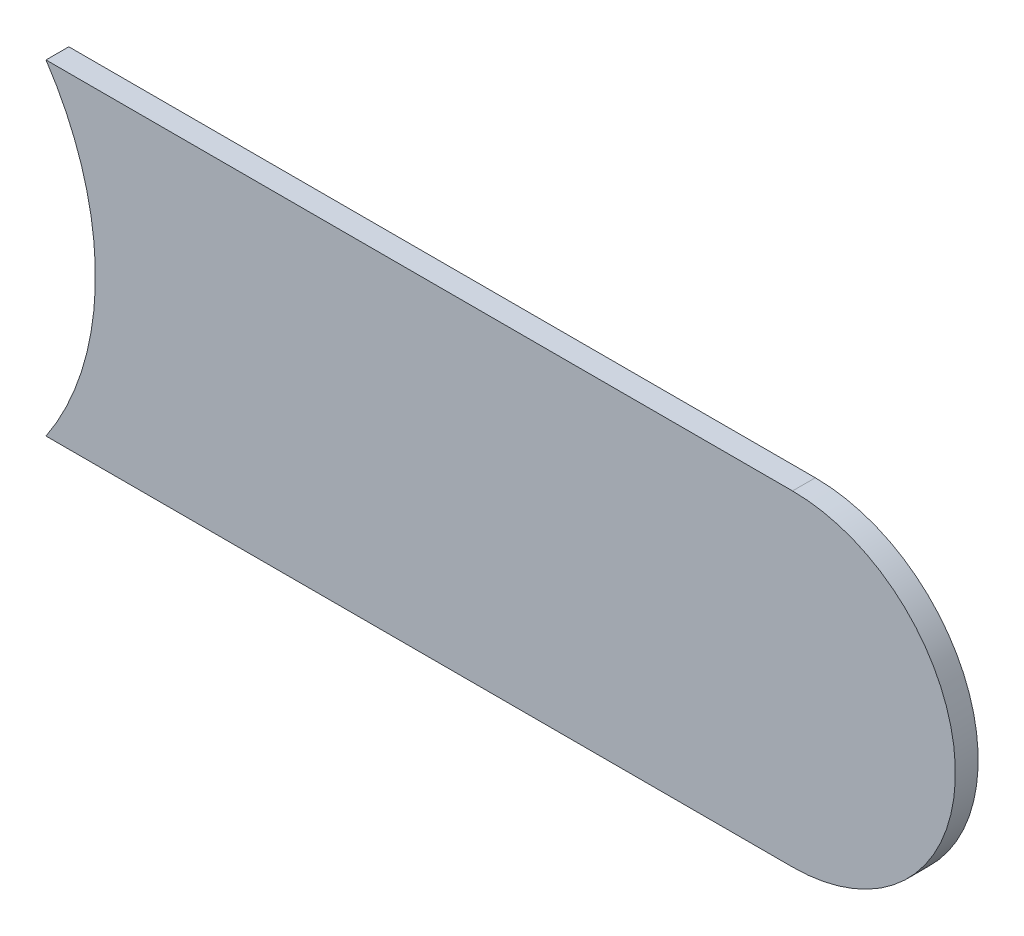
ISO-10303-21;
HEADER;
FILE_DESCRIPTION(('STEP AP214'),'2;1');
FILE_NAME('part.step','',(''),(''),'','','');
FILE_SCHEMA(('AUTOMOTIVE_DESIGN { 1 0 10303 214 1 1 1 1 }'));
ENDSEC;
DATA;
#1=APPLICATION_CONTEXT('core data for automotive mechanical design processes');
#2=APPLICATION_PROTOCOL_DEFINITION('international standard','automotive_design',2000,#1);
#3=PRODUCT_CONTEXT('',#1,'mechanical');
#4=PRODUCT('Part','Part','',(#3));
#5=PRODUCT_RELATED_PRODUCT_CATEGORY('part','',(#4));
#6=PRODUCT_DEFINITION_FORMATION('','',#4);
#7=PRODUCT_DEFINITION_CONTEXT('part definition',#1,'design');
#8=PRODUCT_DEFINITION('design','',#6,#7);
#9=PRODUCT_DEFINITION_SHAPE('','',#8);
#10=(LENGTH_UNIT() NAMED_UNIT(*) SI_UNIT(.MILLI.,.METRE.));
#11=(NAMED_UNIT(*) PLANE_ANGLE_UNIT() SI_UNIT($,.RADIAN.));
#12=(NAMED_UNIT(*) SI_UNIT($,.STERADIAN.) SOLID_ANGLE_UNIT());
#13=UNCERTAINTY_MEASURE_WITH_UNIT(LENGTH_MEASURE(1.E-05),#10,'distance_accuracy_value','');
#14=(GEOMETRIC_REPRESENTATION_CONTEXT(3) GLOBAL_UNCERTAINTY_ASSIGNED_CONTEXT((#13)) GLOBAL_UNIT_ASSIGNED_CONTEXT((#10,
#11,#12)) REPRESENTATION_CONTEXT('',''));
#15=CARTESIAN_POINT('',(0.,0.,0.));
#16=DIRECTION('',(0.,0.,1.));
#17=DIRECTION('',(1.,0.,0.));
#18=AXIS2_PLACEMENT_3D('',#15,#16,#17);
#19=CARTESIAN_POINT('',(178.78,-121.706,-0.035));
#20=DIRECTION('',(0.,-1.,0.));
#21=DIRECTION('',(0.,0.,-1.));
#22=AXIS2_PLACEMENT_3D('',#19,#20,#21);
#23=PLANE('',#22);
#24=DIRECTION('',(0.,0.,-1.));
#25=VECTOR('',#24,1.);
#26=CARTESIAN_POINT('',(177.63416573867,-121.706,-0.045));
#27=LINE('',#26,#25);
#28=CARTESIAN_POINT('',(177.63416573869,-121.706,0.));
#29=VERTEX_POINT('',#28);
#30=CARTESIAN_POINT('',(177.63416573869,-121.706,-0.035));
#31=VERTEX_POINT('',#30);
#32=EDGE_CURVE('E11',#29,#31,#27,.T.);
#33=ORIENTED_EDGE('',*,*,#32,.F.);
#34=DIRECTION('',(-1.,0.,0.));
#35=VECTOR('',#34,1.);
#36=CARTESIAN_POINT('',(178.78,-121.706,0.));
#37=LINE('',#36,#35);
#38=CARTESIAN_POINT('',(178.78,-121.706,0.));
#39=VERTEX_POINT('',#38);
#40=EDGE_CURVE('E26',#39,#29,#37,.T.);
#41=ORIENTED_EDGE('',*,*,#40,.F.);
#42=DIRECTION('',(0.,0.,1.));
#43=VECTOR('',#42,1.);
#44=CARTESIAN_POINT('',(178.78,-121.706,-0.035));
#45=LINE('',#44,#43);
#46=CARTESIAN_POINT('',(178.78,-121.706,-0.035));
#47=VERTEX_POINT('',#46);
#48=EDGE_CURVE('E110',#47,#39,#45,.T.);
#49=ORIENTED_EDGE('',*,*,#48,.F.);
#50=DIRECTION('',(-1.,0.,0.));
#51=VECTOR('',#50,1.);
#52=CARTESIAN_POINT('',(178.78,-121.706,-0.035));
#53=LINE('',#52,#51);
#54=EDGE_CURVE('E103',#47,#31,#53,.T.);
#55=ORIENTED_EDGE('',*,*,#54,.T.);
#56=EDGE_LOOP('',(#33,#41,#49,#55));
#57=FACE_BOUND('',#56,.T.);
#58=ADVANCED_FACE('F17',(#57),#23,.F.);
#59=CARTESIAN_POINT('',(177.26,-121.956,-0.045));
#60=DIRECTION('',(0.,0.,-1.));
#61=DIRECTION('',(0.,-1.,0.));
#62=AXIS2_PLACEMENT_3D('',#59,#60,#61);
#63=CYLINDRICAL_SURFACE('',#62,0.45);
#64=DIRECTION('',(0.,0.,-1.));
#65=VECTOR('',#64,1.);
#66=CARTESIAN_POINT('',(177.63416573867,-122.206,-0.045));
#67=LINE('',#66,#65);
#68=CARTESIAN_POINT('',(177.63416573867,-122.206,0.));
#69=VERTEX_POINT('',#68);
#70=CARTESIAN_POINT('',(177.63416573867,-122.206,-0.035));
#71=VERTEX_POINT('',#70);
#72=EDGE_CURVE('E78',#69,#71,#67,.T.);
#73=ORIENTED_EDGE('',*,*,#72,.F.);
#74=CARTESIAN_POINT('',(177.26,-121.956,0.));
#75=DIRECTION('',(0.,0.,-1.));
#76=DIRECTION('',(0.,-1.,0.));
#77=AXIS2_PLACEMENT_3D('',#74,#75,#76);
#78=CIRCLE('',#77,0.45);
#79=EDGE_CURVE('E20',#29,#69,#78,.T.);
#80=ORIENTED_EDGE('',*,*,#79,.F.);
#81=ORIENTED_EDGE('',*,*,#32,.T.);
#82=CARTESIAN_POINT('',(177.26,-121.956,-0.035));
#83=DIRECTION('',(0.,0.,-1.));
#84=DIRECTION('',(0.,-1.,0.));
#85=AXIS2_PLACEMENT_3D('',#82,#83,#84);
#86=CIRCLE('',#85,0.45);
#87=EDGE_CURVE('E81',#31,#71,#86,.T.);
#88=ORIENTED_EDGE('',*,*,#87,.T.);
#89=EDGE_LOOP('',(#73,#80,#81,#88));
#90=FACE_BOUND('',#89,.T.);
#91=ADVANCED_FACE('F79',(#90),#63,.F.);
#92=CARTESIAN_POINT('',(177.26,-122.206,0.));
#93=DIRECTION('',(0.,0.,1.));
#94=DIRECTION('',(1.,0.,0.));
#95=AXIS2_PLACEMENT_3D('',#92,#93,#94);
#96=PLANE('',#95);
#97=ORIENTED_EDGE('',*,*,#79,.T.);
#98=DIRECTION('',(1.,0.,0.));
#99=VECTOR('',#98,1.);
#100=CARTESIAN_POINT('',(177.26,-122.206,0.));
#101=LINE('',#100,#99);
#102=CARTESIAN_POINT('',(178.78,-122.206,0.));
#103=VERTEX_POINT('',#102);
#104=EDGE_CURVE('E72',#69,#103,#101,.T.);
#105=ORIENTED_EDGE('',*,*,#104,.T.);
#106=CARTESIAN_POINT('',(178.78,-121.956,0.));
#107=DIRECTION('',(0.,0.,1.));
#108=DIRECTION('',(0.,-1.,0.));
#109=AXIS2_PLACEMENT_3D('',#106,#107,#108);
#110=CIRCLE('',#109,0.25);
#111=EDGE_CURVE('E76',#103,#39,#110,.T.);
#112=ORIENTED_EDGE('',*,*,#111,.T.);
#113=ORIENTED_EDGE('',*,*,#40,.T.);
#114=EDGE_LOOP('',(#97,#105,#112,#113));
#115=FACE_BOUND('',#114,.T.);
#116=ADVANCED_FACE('F70',(#115),#96,.T.);
#117=CARTESIAN_POINT('',(178.78,-121.956,-0.035));
#118=DIRECTION('',(0.,0.,-1.));
#119=DIRECTION('',(0.,-1.,0.));
#120=AXIS2_PLACEMENT_3D('',#117,#118,#119);
#121=CYLINDRICAL_SURFACE('',#120,0.25);
#122=CARTESIAN_POINT('',(178.78,-121.956,-0.035));
#123=DIRECTION('',(0.,0.,1.));
#124=DIRECTION('',(0.,-1.,0.));
#125=AXIS2_PLACEMENT_3D('',#122,#123,#124);
#126=CIRCLE('',#125,0.25);
#127=CARTESIAN_POINT('',(178.78,-122.206,-0.035));
#128=VERTEX_POINT('',#127);
#129=EDGE_CURVE('E104',#128,#47,#126,.T.);
#130=ORIENTED_EDGE('',*,*,#129,.T.);
#131=ORIENTED_EDGE('',*,*,#48,.T.);
#132=ORIENTED_EDGE('',*,*,#111,.F.);
#133=DIRECTION('',(0.,0.,1.));
#134=VECTOR('',#133,1.);
#135=CARTESIAN_POINT('',(178.78,-122.206,-0.035));
#136=LINE('',#135,#134);
#137=EDGE_CURVE('E90',#128,#103,#136,.T.);
#138=ORIENTED_EDGE('',*,*,#137,.F.);
#139=EDGE_LOOP('',(#130,#131,#132,#138));
#140=FACE_BOUND('',#139,.T.);
#141=ADVANCED_FACE('F117',(#140),#121,.T.);
#142=CARTESIAN_POINT('',(177.26,-122.206,-0.035));
#143=DIRECTION('',(0.,0.,1.));
#144=DIRECTION('',(1.,0.,0.));
#145=AXIS2_PLACEMENT_3D('',#142,#143,#144);
#146=PLANE('',#145);
#147=ORIENTED_EDGE('',*,*,#54,.F.);
#148=ORIENTED_EDGE('',*,*,#129,.F.);
#149=DIRECTION('',(1.,0.,0.));
#150=VECTOR('',#149,1.);
#151=CARTESIAN_POINT('',(177.26,-122.206,-0.035));
#152=LINE('',#151,#150);
#153=EDGE_CURVE('E86',#71,#128,#152,.T.);
#154=ORIENTED_EDGE('',*,*,#153,.F.);
#155=ORIENTED_EDGE('',*,*,#87,.F.);
#156=EDGE_LOOP('',(#147,#148,#154,#155));
#157=FACE_BOUND('',#156,.T.);
#158=ADVANCED_FACE('F153',(#157),#146,.F.);
#159=CARTESIAN_POINT('',(177.26,-122.206,-0.035));
#160=DIRECTION('',(0.,1.,0.));
#161=DIRECTION('',(1.,0.,0.));
#162=AXIS2_PLACEMENT_3D('',#159,#160,#161);
#163=PLANE('',#162);
#164=ORIENTED_EDGE('',*,*,#137,.T.);
#165=ORIENTED_EDGE('',*,*,#104,.F.);
#166=ORIENTED_EDGE('',*,*,#72,.T.);
#167=ORIENTED_EDGE('',*,*,#153,.T.);
#168=EDGE_LOOP('',(#164,#165,#166,#167));
#169=FACE_BOUND('',#168,.T.);
#170=ADVANCED_FACE('F88',(#169),#163,.F.);
#171=CLOSED_SHELL('',(#58,#91,#116,#141,#158,#170));
#172=MANIFOLD_SOLID_BREP('B1',#171);
#173=ADVANCED_BREP_SHAPE_REPRESENTATION('',(#18,#172),#14);
#174=SHAPE_DEFINITION_REPRESENTATION(#9,#173);
ENDSEC;
END-ISO-10303-21;
